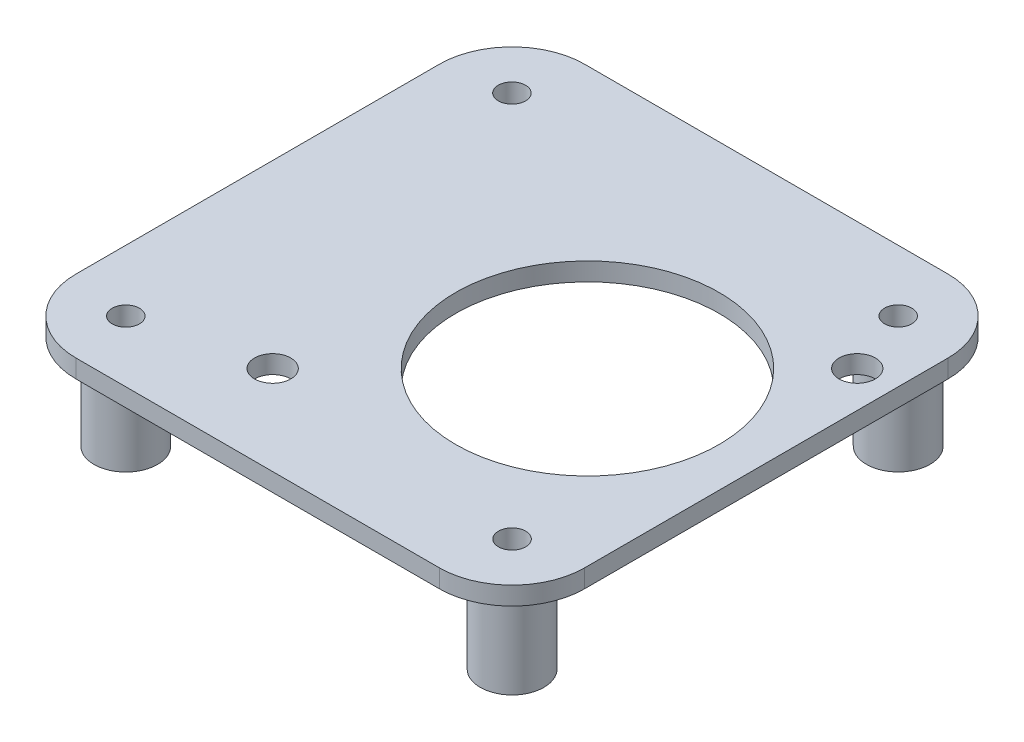
ISO-10303-21;
HEADER;
FILE_DESCRIPTION(('STEP AP214'),'2;1');
FILE_NAME('part.step','',(''),(''),'','','');
FILE_SCHEMA(('AUTOMOTIVE_DESIGN { 1 0 10303 214 1 1 1 1 }'));
ENDSEC;
DATA;
#1=APPLICATION_CONTEXT('core data for automotive mechanical design processes');
#2=APPLICATION_PROTOCOL_DEFINITION('international standard','automotive_design',2000,#1);
#3=PRODUCT_CONTEXT('',#1,'mechanical');
#4=PRODUCT('Part','Part','',(#3));
#5=PRODUCT_RELATED_PRODUCT_CATEGORY('part','',(#4));
#6=PRODUCT_DEFINITION_FORMATION('','',#4);
#7=PRODUCT_DEFINITION_CONTEXT('part definition',#1,'design');
#8=PRODUCT_DEFINITION('design','',#6,#7);
#9=PRODUCT_DEFINITION_SHAPE('','',#8);
#10=(LENGTH_UNIT() NAMED_UNIT(*) SI_UNIT(.MILLI.,.METRE.));
#11=(NAMED_UNIT(*) PLANE_ANGLE_UNIT() SI_UNIT($,.RADIAN.));
#12=(NAMED_UNIT(*) SI_UNIT($,.STERADIAN.) SOLID_ANGLE_UNIT());
#13=UNCERTAINTY_MEASURE_WITH_UNIT(LENGTH_MEASURE(1.E-05),#10,'distance_accuracy_value','');
#14=(GEOMETRIC_REPRESENTATION_CONTEXT(3) GLOBAL_UNCERTAINTY_ASSIGNED_CONTEXT((#13)) GLOBAL_UNIT_ASSIGNED_CONTEXT((#10,
#11,#12)) REPRESENTATION_CONTEXT('',''));
#15=CARTESIAN_POINT('',(0.,0.,0.));
#16=DIRECTION('',(0.,0.,1.));
#17=DIRECTION('',(1.,0.,0.));
#18=AXIS2_PLACEMENT_3D('',#15,#16,#17);
#19=CARTESIAN_POINT('',(0.,0.,0.));
#20=DIRECTION('',(0.,-1.,0.));
#21=DIRECTION('',(0.,0.,-1.));
#22=AXIS2_PLACEMENT_3D('',#19,#20,#21);
#23=PLANE('',#22);
#24=CARTESIAN_POINT('',(8.55979999999997,0.,-62.5475));
#25=DIRECTION('',(0.,-1.,0.));
#26=DIRECTION('',(0.,0.,-1.));
#27=AXIS2_PLACEMENT_3D('',#24,#25,#26);
#28=CIRCLE('',#27,4.445);
#29=CARTESIAN_POINT('',(8.55979999999997,0.,-66.9925));
#30=VERTEX_POINT('',#29);
#31=EDGE_CURVE('E230',#30,#30,#28,.T.);
#32=ORIENTED_EDGE('',*,*,#31,.F.);
#33=EDGE_LOOP('',(#32));
#34=FACE_BOUND('',#33,.T.);
#35=CARTESIAN_POINT('',(62.5602,0.,-8.57250000000001));
#36=DIRECTION('',(0.,-1.,0.));
#37=DIRECTION('',(0.,0.,-1.));
#38=AXIS2_PLACEMENT_3D('',#35,#36,#37);
#39=CIRCLE('',#38,4.445);
#40=CARTESIAN_POINT('',(62.5602,0.,-13.0175));
#41=VERTEX_POINT('',#40);
#42=EDGE_CURVE('E212',#41,#41,#39,.T.);
#43=ORIENTED_EDGE('',*,*,#42,.F.);
#44=EDGE_LOOP('',(#43));
#45=FACE_BOUND('',#44,.T.);
#46=CARTESIAN_POINT('',(47.1814621457548,0.,-34.4814621457547));
#47=DIRECTION('',(0.,1.,0.));
#48=DIRECTION('',(0.,0.,1.));
#49=AXIS2_PLACEMENT_3D('',#46,#47,#48);
#50=CIRCLE('',#49,18.415);
#51=CARTESIAN_POINT('',(47.1814621457548,0.,-16.0664621457547));
#52=VERTEX_POINT('',#51);
#53=EDGE_CURVE('E200',#52,#52,#50,.T.);
#54=ORIENTED_EDGE('',*,*,#53,.T.);
#55=EDGE_LOOP('',(#54));
#56=FACE_BOUND('',#55,.T.);
#57=CARTESIAN_POINT('',(66.04,0.,-53.34));
#58=DIRECTION('',(0.,1.,0.));
#59=DIRECTION('',(0.,0.,1.));
#60=AXIS2_PLACEMENT_3D('',#57,#58,#59);
#61=CIRCLE('',#60,2.53999999999998);
#62=CARTESIAN_POINT('',(66.04,0.,-50.8));
#63=VERTEX_POINT('',#62);
#64=EDGE_CURVE('E194',#63,#63,#61,.T.);
#65=ORIENTED_EDGE('',*,*,#64,.T.);
#66=EDGE_LOOP('',(#65));
#67=FACE_BOUND('',#66,.T.);
#68=CARTESIAN_POINT('',(25.1798346491354,0.,-12.4798346491353));
#69=DIRECTION('',(0.,1.,0.));
#70=DIRECTION('',(0.,0.,1.));
#71=AXIS2_PLACEMENT_3D('',#68,#69,#70);
#72=CIRCLE('',#71,2.54);
#73=CARTESIAN_POINT('',(25.1798346491354,0.,-9.93983464913527));
#74=VERTEX_POINT('',#73);
#75=EDGE_CURVE('E190',#74,#74,#72,.T.);
#76=ORIENTED_EDGE('',*,*,#75,.T.);
#77=EDGE_LOOP('',(#76));
#78=FACE_BOUND('',#77,.T.);
#79=DIRECTION('',(1.,0.,0.));
#80=VECTOR('',#79,1.);
#81=CARTESIAN_POINT('',(0.,0.,0.));
#82=LINE('',#81,#80);
#83=CARTESIAN_POINT('',(10.16,0.,0.));
#84=VERTEX_POINT('',#83);
#85=CARTESIAN_POINT('',(60.96,0.,0.));
#86=VERTEX_POINT('',#85);
#87=EDGE_CURVE('E119',#84,#86,#82,.T.);
#88=ORIENTED_EDGE('',*,*,#87,.F.);
#89=CARTESIAN_POINT('',(10.16,0.,-10.16));
#90=DIRECTION('',(0.,-1.,0.));
#91=DIRECTION('',(0.,0.,-1.));
#92=AXIS2_PLACEMENT_3D('',#89,#90,#91);
#93=CIRCLE('',#92,10.16);
#94=CARTESIAN_POINT('',(0.,0.,-10.16));
#95=VERTEX_POINT('',#94);
#96=EDGE_CURVE('E102',#84,#95,#93,.T.);
#97=ORIENTED_EDGE('',*,*,#96,.T.);
#98=DIRECTION('',(0.,0.,1.));
#99=VECTOR('',#98,1.);
#100=CARTESIAN_POINT('',(0.,0.,0.));
#101=LINE('',#100,#99);
#102=CARTESIAN_POINT('',(0.,0.,-60.96));
#103=VERTEX_POINT('',#102);
#104=EDGE_CURVE('E129',#103,#95,#101,.T.);
#105=ORIENTED_EDGE('',*,*,#104,.F.);
#106=CARTESIAN_POINT('',(10.16,0.,-60.96));
#107=DIRECTION('',(0.,-1.,0.));
#108=DIRECTION('',(0.,0.,-1.));
#109=AXIS2_PLACEMENT_3D('',#106,#107,#108);
#110=CIRCLE('',#109,10.16);
#111=CARTESIAN_POINT('',(10.16,0.,-71.12));
#112=VERTEX_POINT('',#111);
#113=EDGE_CURVE('E113',#103,#112,#110,.T.);
#114=ORIENTED_EDGE('',*,*,#113,.T.);
#115=DIRECTION('',(-1.,0.,0.));
#116=VECTOR('',#115,1.);
#117=CARTESIAN_POINT('',(0.,0.,-71.12));
#118=LINE('',#117,#116);
#119=CARTESIAN_POINT('',(60.96,0.,-71.12));
#120=VERTEX_POINT('',#119);
#121=EDGE_CURVE('E132',#120,#112,#118,.T.);
#122=ORIENTED_EDGE('',*,*,#121,.F.);
#123=CARTESIAN_POINT('',(60.96,0.,-60.96));
#124=DIRECTION('',(0.,-1.,0.));
#125=DIRECTION('',(0.,0.,-1.));
#126=AXIS2_PLACEMENT_3D('',#123,#124,#125);
#127=CIRCLE('',#126,10.16);
#128=CARTESIAN_POINT('',(71.12,0.,-60.96));
#129=VERTEX_POINT('',#128);
#130=EDGE_CURVE('E143',#120,#129,#127,.T.);
#131=ORIENTED_EDGE('',*,*,#130,.T.);
#132=DIRECTION('',(0.,0.,-1.));
#133=VECTOR('',#132,1.);
#134=CARTESIAN_POINT('',(71.12,0.,0.));
#135=LINE('',#134,#133);
#136=CARTESIAN_POINT('',(71.12,0.,-10.16));
#137=VERTEX_POINT('',#136);
#138=EDGE_CURVE('E128',#137,#129,#135,.T.);
#139=ORIENTED_EDGE('',*,*,#138,.F.);
#140=CARTESIAN_POINT('',(60.96,0.,-10.16));
#141=DIRECTION('',(0.,-1.,0.));
#142=DIRECTION('',(0.,0.,-1.));
#143=AXIS2_PLACEMENT_3D('',#140,#141,#142);
#144=CIRCLE('',#143,10.16);
#145=EDGE_CURVE('E123',#137,#86,#144,.T.);
#146=ORIENTED_EDGE('',*,*,#145,.T.);
#147=EDGE_LOOP('',(#88,#97,#105,#114,#122,#131,#139,#146));
#148=FACE_BOUND('',#147,.T.);
#149=CARTESIAN_POINT('',(62.5475,0.,-62.5602));
#150=DIRECTION('',(0.,-1.,0.));
#151=DIRECTION('',(0.,0.,-1.));
#152=AXIS2_PLACEMENT_3D('',#149,#150,#151);
#153=CIRCLE('',#152,4.445);
#154=CARTESIAN_POINT('',(62.5475,0.,-67.0052));
#155=VERTEX_POINT('',#154);
#156=EDGE_CURVE('E221',#155,#155,#153,.T.);
#157=ORIENTED_EDGE('',*,*,#156,.F.);
#158=EDGE_LOOP('',(#157));
#159=FACE_BOUND('',#158,.T.);
#160=CARTESIAN_POINT('',(8.57249999999998,0.,-8.5598));
#161=DIRECTION('',(0.,-1.,0.));
#162=DIRECTION('',(0.,0.,-1.));
#163=AXIS2_PLACEMENT_3D('',#160,#161,#162);
#164=CIRCLE('',#163,4.445);
#165=CARTESIAN_POINT('',(8.57249999999998,0.,-13.0048));
#166=VERTEX_POINT('',#165);
#167=EDGE_CURVE('E239',#166,#166,#164,.T.);
#168=ORIENTED_EDGE('',*,*,#167,.F.);
#169=EDGE_LOOP('',(#168));
#170=FACE_BOUND('',#169,.T.);
#171=ADVANCED_FACE('F36',(#34,#45,#56,#67,#78,#148,#159,#170),#23,.T.);
#172=CARTESIAN_POINT('',(0.,2.54,0.));
#173=DIRECTION('',(0.,-1.,0.));
#174=DIRECTION('',(0.,0.,-1.));
#175=AXIS2_PLACEMENT_3D('',#172,#173,#174);
#176=PLANE('',#175);
#177=CARTESIAN_POINT('',(47.1814621457548,2.54,-34.4814621457547));
#178=DIRECTION('',(0.,1.,0.));
#179=DIRECTION('',(0.,0.,1.));
#180=AXIS2_PLACEMENT_3D('',#177,#178,#179);
#181=CIRCLE('',#180,18.415);
#182=CARTESIAN_POINT('',(47.1814621457548,2.54,-16.0664621457547));
#183=VERTEX_POINT('',#182);
#184=EDGE_CURVE('E203',#183,#183,#181,.T.);
#185=ORIENTED_EDGE('',*,*,#184,.F.);
#186=EDGE_LOOP('',(#185));
#187=FACE_BOUND('',#186,.T.);
#188=CARTESIAN_POINT('',(66.04,2.54,-53.34));
#189=DIRECTION('',(0.,1.,0.));
#190=DIRECTION('',(0.,0.,1.));
#191=AXIS2_PLACEMENT_3D('',#188,#189,#190);
#192=CIRCLE('',#191,2.53999999999998);
#193=CARTESIAN_POINT('',(66.04,2.54,-50.8));
#194=VERTEX_POINT('',#193);
#195=EDGE_CURVE('E197',#194,#194,#192,.T.);
#196=ORIENTED_EDGE('',*,*,#195,.F.);
#197=EDGE_LOOP('',(#196));
#198=FACE_BOUND('',#197,.T.);
#199=CARTESIAN_POINT('',(25.1798346491354,2.54,-12.4798346491353));
#200=DIRECTION('',(0.,1.,0.));
#201=DIRECTION('',(0.,0.,1.));
#202=AXIS2_PLACEMENT_3D('',#199,#200,#201);
#203=CIRCLE('',#202,2.54);
#204=CARTESIAN_POINT('',(25.1798346491354,2.54,-9.93983464913527));
#205=VERTEX_POINT('',#204);
#206=EDGE_CURVE('E191',#205,#205,#203,.T.);
#207=ORIENTED_EDGE('',*,*,#206,.F.);
#208=EDGE_LOOP('',(#207));
#209=FACE_BOUND('',#208,.T.);
#210=DIRECTION('',(0.,0.,1.));
#211=VECTOR('',#210,1.);
#212=CARTESIAN_POINT('',(0.,2.54,0.));
#213=LINE('',#212,#211);
#214=CARTESIAN_POINT('',(0.,2.54,-60.96));
#215=VERTEX_POINT('',#214);
#216=CARTESIAN_POINT('',(0.,2.54,-10.16));
#217=VERTEX_POINT('',#216);
#218=EDGE_CURVE('E139',#215,#217,#213,.T.);
#219=ORIENTED_EDGE('',*,*,#218,.T.);
#220=CARTESIAN_POINT('',(10.16,2.54,-10.16));
#221=DIRECTION('',(0.,-1.,0.));
#222=DIRECTION('',(0.,0.,-1.));
#223=AXIS2_PLACEMENT_3D('',#220,#221,#222);
#224=CIRCLE('',#223,10.16);
#225=CARTESIAN_POINT('',(10.16,2.54,0.));
#226=VERTEX_POINT('',#225);
#227=EDGE_CURVE('E154',#217,#226,#224,.F.);
#228=ORIENTED_EDGE('',*,*,#227,.T.);
#229=DIRECTION('',(1.,0.,0.));
#230=VECTOR('',#229,1.);
#231=CARTESIAN_POINT('',(0.,2.54,0.));
#232=LINE('',#231,#230);
#233=CARTESIAN_POINT('',(60.96,2.54,0.));
#234=VERTEX_POINT('',#233);
#235=EDGE_CURVE('E122',#226,#234,#232,.T.);
#236=ORIENTED_EDGE('',*,*,#235,.T.);
#237=CARTESIAN_POINT('',(60.96,2.54,-10.16));
#238=DIRECTION('',(0.,-1.,0.));
#239=DIRECTION('',(0.,0.,-1.));
#240=AXIS2_PLACEMENT_3D('',#237,#238,#239);
#241=CIRCLE('',#240,10.16);
#242=CARTESIAN_POINT('',(71.12,2.54,-10.16));
#243=VERTEX_POINT('',#242);
#244=EDGE_CURVE('E149',#234,#243,#241,.F.);
#245=ORIENTED_EDGE('',*,*,#244,.T.);
#246=DIRECTION('',(0.,0.,-1.));
#247=VECTOR('',#246,1.);
#248=CARTESIAN_POINT('',(71.12,2.54,0.));
#249=LINE('',#248,#247);
#250=CARTESIAN_POINT('',(71.12,2.54,-60.96));
#251=VERTEX_POINT('',#250);
#252=EDGE_CURVE('E165',#243,#251,#249,.T.);
#253=ORIENTED_EDGE('',*,*,#252,.T.);
#254=CARTESIAN_POINT('',(60.96,2.54,-60.96));
#255=DIRECTION('',(0.,-1.,0.));
#256=DIRECTION('',(0.,0.,-1.));
#257=AXIS2_PLACEMENT_3D('',#254,#255,#256);
#258=CIRCLE('',#257,10.16);
#259=CARTESIAN_POINT('',(60.96,2.54,-71.12));
#260=VERTEX_POINT('',#259);
#261=EDGE_CURVE('E58',#251,#260,#258,.F.);
#262=ORIENTED_EDGE('',*,*,#261,.T.);
#263=DIRECTION('',(-1.,0.,0.));
#264=VECTOR('',#263,1.);
#265=CARTESIAN_POINT('',(0.,2.54,-71.12));
#266=LINE('',#265,#264);
#267=CARTESIAN_POINT('',(10.16,2.54,-71.12));
#268=VERTEX_POINT('',#267);
#269=EDGE_CURVE('E140',#260,#268,#266,.T.);
#270=ORIENTED_EDGE('',*,*,#269,.T.);
#271=CARTESIAN_POINT('',(10.16,2.54,-60.96));
#272=DIRECTION('',(0.,-1.,0.));
#273=DIRECTION('',(0.,0.,-1.));
#274=AXIS2_PLACEMENT_3D('',#271,#272,#273);
#275=CIRCLE('',#274,10.16);
#276=EDGE_CURVE('E152',#268,#215,#275,.F.);
#277=ORIENTED_EDGE('',*,*,#276,.T.);
#278=EDGE_LOOP('',(#219,#228,#236,#245,#253,#262,#270,#277));
#279=FACE_BOUND('',#278,.T.);
#280=CARTESIAN_POINT('',(8.55979999999997,2.54,-62.5475));
#281=DIRECTION('',(0.,1.,0.));
#282=DIRECTION('',(0.,0.,1.));
#283=AXIS2_PLACEMENT_3D('',#280,#281,#282);
#284=CIRCLE('',#283,1.905);
#285=CARTESIAN_POINT('',(8.55979999999997,2.54,-60.6425));
#286=VERTEX_POINT('',#285);
#287=EDGE_CURVE('E134',#286,#286,#284,.T.);
#288=ORIENTED_EDGE('',*,*,#287,.F.);
#289=EDGE_LOOP('',(#288));
#290=FACE_BOUND('',#289,.T.);
#291=CARTESIAN_POINT('',(62.5475,2.54,-62.5602));
#292=DIRECTION('',(0.,1.,0.));
#293=DIRECTION('',(0.,0.,1.));
#294=AXIS2_PLACEMENT_3D('',#291,#292,#293);
#295=CIRCLE('',#294,1.90500000000001);
#296=CARTESIAN_POINT('',(62.5475,2.54,-60.6552));
#297=VERTEX_POINT('',#296);
#298=EDGE_CURVE('E181',#297,#297,#295,.T.);
#299=ORIENTED_EDGE('',*,*,#298,.F.);
#300=EDGE_LOOP('',(#299));
#301=FACE_BOUND('',#300,.T.);
#302=CARTESIAN_POINT('',(62.5602,2.54,-8.57250000000001));
#303=DIRECTION('',(0.,1.,0.));
#304=DIRECTION('',(0.,0.,1.));
#305=AXIS2_PLACEMENT_3D('',#302,#303,#304);
#306=CIRCLE('',#305,1.90500000000001);
#307=CARTESIAN_POINT('',(62.5602,2.54,-6.6675));
#308=VERTEX_POINT('',#307);
#309=EDGE_CURVE('E184',#308,#308,#306,.T.);
#310=ORIENTED_EDGE('',*,*,#309,.F.);
#311=EDGE_LOOP('',(#310));
#312=FACE_BOUND('',#311,.T.);
#313=CARTESIAN_POINT('',(8.57249999999998,2.54,-8.5598));
#314=DIRECTION('',(0.,1.,0.));
#315=DIRECTION('',(0.,0.,1.));
#316=AXIS2_PLACEMENT_3D('',#313,#314,#315);
#317=CIRCLE('',#316,1.905);
#318=CARTESIAN_POINT('',(8.57249999999998,2.54,-6.6548));
#319=VERTEX_POINT('',#318);
#320=EDGE_CURVE('E187',#319,#319,#317,.T.);
#321=ORIENTED_EDGE('',*,*,#320,.F.);
#322=EDGE_LOOP('',(#321));
#323=FACE_BOUND('',#322,.T.);
#324=ADVANCED_FACE('F262',(#187,#198,#209,#279,#290,#301,#312,#323),#176,.F.);
#325=CARTESIAN_POINT('',(0.,2.54,0.));
#326=DIRECTION('',(1.,0.,0.));
#327=DIRECTION('',(0.,0.,-1.));
#328=AXIS2_PLACEMENT_3D('',#325,#326,#327);
#329=PLANE('',#328);
#330=ORIENTED_EDGE('',*,*,#104,.T.);
#331=DIRECTION('',(0.,-1.,0.));
#332=VECTOR('',#331,1.);
#333=CARTESIAN_POINT('',(0.,2.54,-10.16));
#334=LINE('',#333,#332);
#335=EDGE_CURVE('E107',#95,#217,#334,.F.);
#336=ORIENTED_EDGE('',*,*,#335,.T.);
#337=ORIENTED_EDGE('',*,*,#218,.F.);
#338=DIRECTION('',(0.,-1.,0.));
#339=VECTOR('',#338,1.);
#340=CARTESIAN_POINT('',(0.,2.54,-60.96));
#341=LINE('',#340,#339);
#342=EDGE_CURVE('E112',#215,#103,#341,.T.);
#343=ORIENTED_EDGE('',*,*,#342,.T.);
#344=EDGE_LOOP('',(#330,#336,#337,#343));
#345=FACE_BOUND('',#344,.T.);
#346=ADVANCED_FACE('F268',(#345),#329,.F.);
#347=CARTESIAN_POINT('',(0.,2.54,0.));
#348=DIRECTION('',(0.,0.,-1.));
#349=DIRECTION('',(-1.,0.,0.));
#350=AXIS2_PLACEMENT_3D('',#347,#348,#349);
#351=PLANE('',#350);
#352=ORIENTED_EDGE('',*,*,#235,.F.);
#353=DIRECTION('',(0.,-1.,0.));
#354=VECTOR('',#353,1.);
#355=CARTESIAN_POINT('',(10.16,2.54,0.));
#356=LINE('',#355,#354);
#357=EDGE_CURVE('E106',#226,#84,#356,.T.);
#358=ORIENTED_EDGE('',*,*,#357,.T.);
#359=ORIENTED_EDGE('',*,*,#87,.T.);
#360=DIRECTION('',(0.,-1.,0.));
#361=VECTOR('',#360,1.);
#362=CARTESIAN_POINT('',(60.96,2.54,0.));
#363=LINE('',#362,#361);
#364=EDGE_CURVE('E124',#86,#234,#363,.F.);
#365=ORIENTED_EDGE('',*,*,#364,.T.);
#366=EDGE_LOOP('',(#352,#358,#359,#365));
#367=FACE_BOUND('',#366,.T.);
#368=ADVANCED_FACE('F118',(#367),#351,.F.);
#369=CARTESIAN_POINT('',(71.12,2.54,0.));
#370=DIRECTION('',(-1.,0.,0.));
#371=DIRECTION('',(0.,0.,1.));
#372=AXIS2_PLACEMENT_3D('',#369,#370,#371);
#373=PLANE('',#372);
#374=ORIENTED_EDGE('',*,*,#138,.T.);
#375=DIRECTION('',(0.,-1.,0.));
#376=VECTOR('',#375,1.);
#377=CARTESIAN_POINT('',(71.12,2.54,-60.96));
#378=LINE('',#377,#376);
#379=EDGE_CURVE('E12',#129,#251,#378,.F.);
#380=ORIENTED_EDGE('',*,*,#379,.T.);
#381=ORIENTED_EDGE('',*,*,#252,.F.);
#382=DIRECTION('',(0.,-1.,0.));
#383=VECTOR('',#382,1.);
#384=CARTESIAN_POINT('',(71.12,2.54,-10.16));
#385=LINE('',#384,#383);
#386=EDGE_CURVE('E44',#243,#137,#385,.T.);
#387=ORIENTED_EDGE('',*,*,#386,.T.);
#388=EDGE_LOOP('',(#374,#380,#381,#387));
#389=FACE_BOUND('',#388,.T.);
#390=ADVANCED_FACE('F163',(#389),#373,.F.);
#391=CARTESIAN_POINT('',(0.,2.54,-71.12));
#392=DIRECTION('',(0.,0.,1.));
#393=DIRECTION('',(1.,0.,0.));
#394=AXIS2_PLACEMENT_3D('',#391,#392,#393);
#395=PLANE('',#394);
#396=ORIENTED_EDGE('',*,*,#121,.T.);
#397=DIRECTION('',(0.,-1.,0.));
#398=VECTOR('',#397,1.);
#399=CARTESIAN_POINT('',(10.16,2.54,-71.12));
#400=LINE('',#399,#398);
#401=EDGE_CURVE('E51',#112,#268,#400,.F.);
#402=ORIENTED_EDGE('',*,*,#401,.T.);
#403=ORIENTED_EDGE('',*,*,#269,.F.);
#404=DIRECTION('',(0.,-1.,0.));
#405=VECTOR('',#404,1.);
#406=CARTESIAN_POINT('',(60.96,2.54,-71.12));
#407=LINE('',#406,#405);
#408=EDGE_CURVE('E156',#260,#120,#407,.T.);
#409=ORIENTED_EDGE('',*,*,#408,.T.);
#410=EDGE_LOOP('',(#396,#402,#403,#409));
#411=FACE_BOUND('',#410,.T.);
#412=ADVANCED_FACE('F172',(#411),#395,.F.);
#413=CARTESIAN_POINT('',(8.55979999999997,2.54,-62.5475));
#414=DIRECTION('',(0.,-1.,0.));
#415=DIRECTION('',(0.,0.,-1.));
#416=AXIS2_PLACEMENT_3D('',#413,#414,#415);
#417=CYLINDRICAL_SURFACE('',#416,1.905);
#418=ORIENTED_EDGE('',*,*,#287,.T.);
#419=EDGE_LOOP('',(#418));
#420=FACE_BOUND('',#419,.T.);
#421=CARTESIAN_POINT('',(8.55979999999997,-13.208,-62.5475));
#422=DIRECTION('',(0.,-1.,0.));
#423=DIRECTION('',(0.,0.,-1.));
#424=AXIS2_PLACEMENT_3D('',#421,#422,#423);
#425=CIRCLE('',#424,1.905);
#426=CARTESIAN_POINT('',(8.55979999999997,-13.208,-64.4525));
#427=VERTEX_POINT('',#426);
#428=EDGE_CURVE('E227',#427,#427,#425,.T.);
#429=ORIENTED_EDGE('',*,*,#428,.T.);
#430=EDGE_LOOP('',(#429));
#431=FACE_BOUND('',#430,.T.);
#432=ADVANCED_FACE('F277',(#420,#431),#417,.F.);
#433=CARTESIAN_POINT('',(62.5475,2.54,-62.5602));
#434=DIRECTION('',(0.,-1.,0.));
#435=DIRECTION('',(0.,0.,-1.));
#436=AXIS2_PLACEMENT_3D('',#433,#434,#435);
#437=CYLINDRICAL_SURFACE('',#436,1.90500000000001);
#438=ORIENTED_EDGE('',*,*,#298,.T.);
#439=EDGE_LOOP('',(#438));
#440=FACE_BOUND('',#439,.T.);
#441=CARTESIAN_POINT('',(62.5475,-13.208,-62.5602));
#442=DIRECTION('',(0.,-1.,0.));
#443=DIRECTION('',(0.,0.,-1.));
#444=AXIS2_PLACEMENT_3D('',#441,#442,#443);
#445=CIRCLE('',#444,1.90500000000001);
#446=CARTESIAN_POINT('',(62.5475,-13.208,-64.4652));
#447=VERTEX_POINT('',#446);
#448=EDGE_CURVE('E218',#447,#447,#445,.T.);
#449=ORIENTED_EDGE('',*,*,#448,.T.);
#450=EDGE_LOOP('',(#449));
#451=FACE_BOUND('',#450,.T.);
#452=ADVANCED_FACE('F321',(#440,#451),#437,.F.);
#453=CARTESIAN_POINT('',(62.5602,2.54,-8.57250000000001));
#454=DIRECTION('',(0.,-1.,0.));
#455=DIRECTION('',(0.,0.,-1.));
#456=AXIS2_PLACEMENT_3D('',#453,#454,#455);
#457=CYLINDRICAL_SURFACE('',#456,1.90500000000001);
#458=ORIENTED_EDGE('',*,*,#309,.T.);
#459=EDGE_LOOP('',(#458));
#460=FACE_BOUND('',#459,.T.);
#461=CARTESIAN_POINT('',(62.5602,-13.208,-8.57250000000001));
#462=DIRECTION('',(0.,-1.,0.));
#463=DIRECTION('',(0.,0.,-1.));
#464=AXIS2_PLACEMENT_3D('',#461,#462,#463);
#465=CIRCLE('',#464,1.90500000000001);
#466=CARTESIAN_POINT('',(62.5602,-13.208,-10.4775));
#467=VERTEX_POINT('',#466);
#468=EDGE_CURVE('E209',#467,#467,#465,.T.);
#469=ORIENTED_EDGE('',*,*,#468,.T.);
#470=EDGE_LOOP('',(#469));
#471=FACE_BOUND('',#470,.T.);
#472=ADVANCED_FACE('F311',(#460,#471),#457,.F.);
#473=CARTESIAN_POINT('',(8.57249999999998,2.54,-8.5598));
#474=DIRECTION('',(0.,-1.,0.));
#475=DIRECTION('',(0.,0.,-1.));
#476=AXIS2_PLACEMENT_3D('',#473,#474,#475);
#477=CYLINDRICAL_SURFACE('',#476,1.905);
#478=ORIENTED_EDGE('',*,*,#320,.T.);
#479=EDGE_LOOP('',(#478));
#480=FACE_BOUND('',#479,.T.);
#481=CARTESIAN_POINT('',(8.57249999999998,-13.208,-8.5598));
#482=DIRECTION('',(0.,-1.,0.));
#483=DIRECTION('',(0.,0.,-1.));
#484=AXIS2_PLACEMENT_3D('',#481,#482,#483);
#485=CIRCLE('',#484,1.905);
#486=CARTESIAN_POINT('',(8.57249999999998,-13.208,-10.4648));
#487=VERTEX_POINT('',#486);
#488=EDGE_CURVE('E236',#487,#487,#485,.T.);
#489=ORIENTED_EDGE('',*,*,#488,.T.);
#490=EDGE_LOOP('',(#489));
#491=FACE_BOUND('',#490,.T.);
#492=ADVANCED_FACE('F307',(#480,#491),#477,.F.);
#493=CARTESIAN_POINT('',(25.1798346491354,0.,-12.4798346491353));
#494=DIRECTION('',(0.,1.,0.));
#495=DIRECTION('',(0.,0.,1.));
#496=AXIS2_PLACEMENT_3D('',#493,#494,#495);
#497=CYLINDRICAL_SURFACE('',#496,2.54);
#498=ORIENTED_EDGE('',*,*,#75,.F.);
#499=EDGE_LOOP('',(#498));
#500=FACE_BOUND('',#499,.T.);
#501=ORIENTED_EDGE('',*,*,#206,.T.);
#502=EDGE_LOOP('',(#501));
#503=FACE_BOUND('',#502,.T.);
#504=ADVANCED_FACE('F310',(#500,#503),#497,.F.);
#505=CARTESIAN_POINT('',(66.04,0.,-53.34));
#506=DIRECTION('',(0.,1.,0.));
#507=DIRECTION('',(0.,0.,1.));
#508=AXIS2_PLACEMENT_3D('',#505,#506,#507);
#509=CYLINDRICAL_SURFACE('',#508,2.53999999999998);
#510=ORIENTED_EDGE('',*,*,#64,.F.);
#511=EDGE_LOOP('',(#510));
#512=FACE_BOUND('',#511,.T.);
#513=ORIENTED_EDGE('',*,*,#195,.T.);
#514=EDGE_LOOP('',(#513));
#515=FACE_BOUND('',#514,.T.);
#516=ADVANCED_FACE('F318',(#512,#515),#509,.F.);
#517=CARTESIAN_POINT('',(47.1814621457548,0.,-34.4814621457547));
#518=DIRECTION('',(0.,1.,0.));
#519=DIRECTION('',(0.,0.,1.));
#520=AXIS2_PLACEMENT_3D('',#517,#518,#519);
#521=CYLINDRICAL_SURFACE('',#520,18.415);
#522=ORIENTED_EDGE('',*,*,#53,.F.);
#523=EDGE_LOOP('',(#522));
#524=FACE_BOUND('',#523,.T.);
#525=ORIENTED_EDGE('',*,*,#184,.T.);
#526=EDGE_LOOP('',(#525));
#527=FACE_BOUND('',#526,.T.);
#528=ADVANCED_FACE('F358',(#524,#527),#521,.F.);
#529=CARTESIAN_POINT('',(62.5602,-41.5283585694968,-8.57250000000001));
#530=DIRECTION('',(0.,1.,0.));
#531=DIRECTION('',(0.,0.,1.));
#532=AXIS2_PLACEMENT_3D('',#529,#530,#531);
#533=CYLINDRICAL_SURFACE('',#532,4.445);
#534=ORIENTED_EDGE('',*,*,#42,.T.);
#535=EDGE_LOOP('',(#534));
#536=FACE_BOUND('',#535,.T.);
#537=CARTESIAN_POINT('',(62.5602,-13.208,-8.57250000000001));
#538=DIRECTION('',(0.,-1.,0.));
#539=DIRECTION('',(0.,0.,-1.));
#540=AXIS2_PLACEMENT_3D('',#537,#538,#539);
#541=CIRCLE('',#540,4.445);
#542=CARTESIAN_POINT('',(62.5602,-13.208,-13.0175));
#543=VERTEX_POINT('',#542);
#544=EDGE_CURVE('E206',#543,#543,#541,.T.);
#545=ORIENTED_EDGE('',*,*,#544,.F.);
#546=EDGE_LOOP('',(#545));
#547=FACE_BOUND('',#546,.T.);
#548=ADVANCED_FACE('F354',(#536,#547),#533,.T.);
#549=CARTESIAN_POINT('',(0.,-13.208,0.));
#550=DIRECTION('',(0.,-1.,0.));
#551=DIRECTION('',(0.,0.,-1.));
#552=AXIS2_PLACEMENT_3D('',#549,#550,#551);
#553=PLANE('',#552);
#554=ORIENTED_EDGE('',*,*,#468,.F.);
#555=EDGE_LOOP('',(#554));
#556=FACE_BOUND('',#555,.T.);
#557=ORIENTED_EDGE('',*,*,#544,.T.);
#558=EDGE_LOOP('',(#557));
#559=FACE_BOUND('',#558,.T.);
#560=ADVANCED_FACE('F350',(#556,#559),#553,.T.);
#561=CARTESIAN_POINT('',(62.5475,-41.5283585694968,-62.5602));
#562=DIRECTION('',(0.,1.,0.));
#563=DIRECTION('',(0.,0.,1.));
#564=AXIS2_PLACEMENT_3D('',#561,#562,#563);
#565=CYLINDRICAL_SURFACE('',#564,4.445);
#566=ORIENTED_EDGE('',*,*,#156,.T.);
#567=EDGE_LOOP('',(#566));
#568=FACE_BOUND('',#567,.T.);
#569=CARTESIAN_POINT('',(62.5475,-13.208,-62.5602));
#570=DIRECTION('',(0.,-1.,0.));
#571=DIRECTION('',(0.,0.,-1.));
#572=AXIS2_PLACEMENT_3D('',#569,#570,#571);
#573=CIRCLE('',#572,4.445);
#574=CARTESIAN_POINT('',(62.5475,-13.208,-67.0052));
#575=VERTEX_POINT('',#574);
#576=EDGE_CURVE('E213',#575,#575,#573,.T.);
#577=ORIENTED_EDGE('',*,*,#576,.F.);
#578=EDGE_LOOP('',(#577));
#579=FACE_BOUND('',#578,.T.);
#580=ADVANCED_FACE('F344',(#568,#579),#565,.T.);
#581=CARTESIAN_POINT('',(0.,-13.208,0.));
#582=DIRECTION('',(0.,-1.,0.));
#583=DIRECTION('',(0.,0.,-1.));
#584=AXIS2_PLACEMENT_3D('',#581,#582,#583);
#585=PLANE('',#584);
#586=ORIENTED_EDGE('',*,*,#448,.F.);
#587=EDGE_LOOP('',(#586));
#588=FACE_BOUND('',#587,.T.);
#589=ORIENTED_EDGE('',*,*,#576,.T.);
#590=EDGE_LOOP('',(#589));
#591=FACE_BOUND('',#590,.T.);
#592=ADVANCED_FACE('F338',(#588,#591),#585,.T.);
#593=CARTESIAN_POINT('',(8.55979999999997,-41.5283585694968,-62.5475));
#594=DIRECTION('',(0.,1.,0.));
#595=DIRECTION('',(0.,0.,1.));
#596=AXIS2_PLACEMENT_3D('',#593,#594,#595);
#597=CYLINDRICAL_SURFACE('',#596,4.445);
#598=ORIENTED_EDGE('',*,*,#31,.T.);
#599=EDGE_LOOP('',(#598));
#600=FACE_BOUND('',#599,.T.);
#601=CARTESIAN_POINT('',(8.55979999999997,-13.208,-62.5475));
#602=DIRECTION('',(0.,-1.,0.));
#603=DIRECTION('',(0.,0.,-1.));
#604=AXIS2_PLACEMENT_3D('',#601,#602,#603);
#605=CIRCLE('',#604,4.445);
#606=CARTESIAN_POINT('',(8.55979999999997,-13.208,-66.9925));
#607=VERTEX_POINT('',#606);
#608=EDGE_CURVE('E222',#607,#607,#605,.T.);
#609=ORIENTED_EDGE('',*,*,#608,.F.);
#610=EDGE_LOOP('',(#609));
#611=FACE_BOUND('',#610,.T.);
#612=ADVANCED_FACE('F258',(#600,#611),#597,.T.);
#613=CARTESIAN_POINT('',(0.,-13.208,0.));
#614=DIRECTION('',(0.,-1.,0.));
#615=DIRECTION('',(0.,0.,-1.));
#616=AXIS2_PLACEMENT_3D('',#613,#614,#615);
#617=PLANE('',#616);
#618=ORIENTED_EDGE('',*,*,#428,.F.);
#619=EDGE_LOOP('',(#618));
#620=FACE_BOUND('',#619,.T.);
#621=ORIENTED_EDGE('',*,*,#608,.T.);
#622=EDGE_LOOP('',(#621));
#623=FACE_BOUND('',#622,.T.);
#624=ADVANCED_FACE('F249',(#620,#623),#617,.T.);
#625=CARTESIAN_POINT('',(8.57249999999998,-41.5283585694968,-8.5598));
#626=DIRECTION('',(0.,1.,0.));
#627=DIRECTION('',(0.,0.,1.));
#628=AXIS2_PLACEMENT_3D('',#625,#626,#627);
#629=CYLINDRICAL_SURFACE('',#628,4.445);
#630=ORIENTED_EDGE('',*,*,#167,.T.);
#631=EDGE_LOOP('',(#630));
#632=FACE_BOUND('',#631,.T.);
#633=CARTESIAN_POINT('',(8.57249999999998,-13.208,-8.5598));
#634=DIRECTION('',(0.,-1.,0.));
#635=DIRECTION('',(0.,0.,-1.));
#636=AXIS2_PLACEMENT_3D('',#633,#634,#635);
#637=CIRCLE('',#636,4.445);
#638=CARTESIAN_POINT('',(8.57249999999998,-13.208,-13.0048));
#639=VERTEX_POINT('',#638);
#640=EDGE_CURVE('E231',#639,#639,#637,.T.);
#641=ORIENTED_EDGE('',*,*,#640,.F.);
#642=EDGE_LOOP('',(#641));
#643=FACE_BOUND('',#642,.T.);
#644=ADVANCED_FACE('F247',(#632,#643),#629,.T.);
#645=CARTESIAN_POINT('',(0.,-13.208,0.));
#646=DIRECTION('',(0.,-1.,0.));
#647=DIRECTION('',(0.,0.,-1.));
#648=AXIS2_PLACEMENT_3D('',#645,#646,#647);
#649=PLANE('',#648);
#650=ORIENTED_EDGE('',*,*,#488,.F.);
#651=EDGE_LOOP('',(#650));
#652=FACE_BOUND('',#651,.T.);
#653=ORIENTED_EDGE('',*,*,#640,.T.);
#654=EDGE_LOOP('',(#653));
#655=FACE_BOUND('',#654,.T.);
#656=ADVANCED_FACE('F245',(#652,#655),#649,.T.);
#657=CARTESIAN_POINT('',(10.16,2.54,-10.16));
#658=DIRECTION('',(0.,-1.,0.));
#659=DIRECTION('',(0.,0.,-1.));
#660=AXIS2_PLACEMENT_3D('',#657,#658,#659);
#661=CYLINDRICAL_SURFACE('',#660,10.16);
#662=ORIENTED_EDGE('',*,*,#227,.F.);
#663=ORIENTED_EDGE('',*,*,#335,.F.);
#664=ORIENTED_EDGE('',*,*,#96,.F.);
#665=ORIENTED_EDGE('',*,*,#357,.F.);
#666=EDGE_LOOP('',(#662,#663,#664,#665));
#667=FACE_BOUND('',#666,.T.);
#668=ADVANCED_FACE('F105',(#667),#661,.T.);
#669=CARTESIAN_POINT('',(10.16,2.54,-60.96));
#670=DIRECTION('',(0.,-1.,0.));
#671=DIRECTION('',(0.,0.,-1.));
#672=AXIS2_PLACEMENT_3D('',#669,#670,#671);
#673=CYLINDRICAL_SURFACE('',#672,10.16);
#674=ORIENTED_EDGE('',*,*,#276,.F.);
#675=ORIENTED_EDGE('',*,*,#401,.F.);
#676=ORIENTED_EDGE('',*,*,#113,.F.);
#677=ORIENTED_EDGE('',*,*,#342,.F.);
#678=EDGE_LOOP('',(#674,#675,#676,#677));
#679=FACE_BOUND('',#678,.T.);
#680=ADVANCED_FACE('F287',(#679),#673,.T.);
#681=CARTESIAN_POINT('',(60.96,2.54,-60.96));
#682=DIRECTION('',(0.,-1.,0.));
#683=DIRECTION('',(0.,0.,-1.));
#684=AXIS2_PLACEMENT_3D('',#681,#682,#683);
#685=CYLINDRICAL_SURFACE('',#684,10.16);
#686=ORIENTED_EDGE('',*,*,#261,.F.);
#687=ORIENTED_EDGE('',*,*,#379,.F.);
#688=ORIENTED_EDGE('',*,*,#130,.F.);
#689=ORIENTED_EDGE('',*,*,#408,.F.);
#690=EDGE_LOOP('',(#686,#687,#688,#689));
#691=FACE_BOUND('',#690,.T.);
#692=ADVANCED_FACE('F171',(#691),#685,.T.);
#693=CARTESIAN_POINT('',(60.96,2.54,-10.16));
#694=DIRECTION('',(0.,-1.,0.));
#695=DIRECTION('',(0.,0.,-1.));
#696=AXIS2_PLACEMENT_3D('',#693,#694,#695);
#697=CYLINDRICAL_SURFACE('',#696,10.16);
#698=ORIENTED_EDGE('',*,*,#244,.F.);
#699=ORIENTED_EDGE('',*,*,#364,.F.);
#700=ORIENTED_EDGE('',*,*,#145,.F.);
#701=ORIENTED_EDGE('',*,*,#386,.F.);
#702=EDGE_LOOP('',(#698,#699,#700,#701));
#703=FACE_BOUND('',#702,.T.);
#704=ADVANCED_FACE('F38',(#703),#697,.T.);
#705=CLOSED_SHELL('',(#171,#324,#346,#368,#390,#412,#432,#452,#472,#492,#504,#516,#528,#548,
#560,#580,#592,#612,#624,#644,#656,#668,#680,#692,#704));
#706=MANIFOLD_SOLID_BREP('B2',#705);
#707=ADVANCED_BREP_SHAPE_REPRESENTATION('',(#18,#706),#14);
#708=SHAPE_DEFINITION_REPRESENTATION(#9,#707);
ENDSEC;
END-ISO-10303-21;
